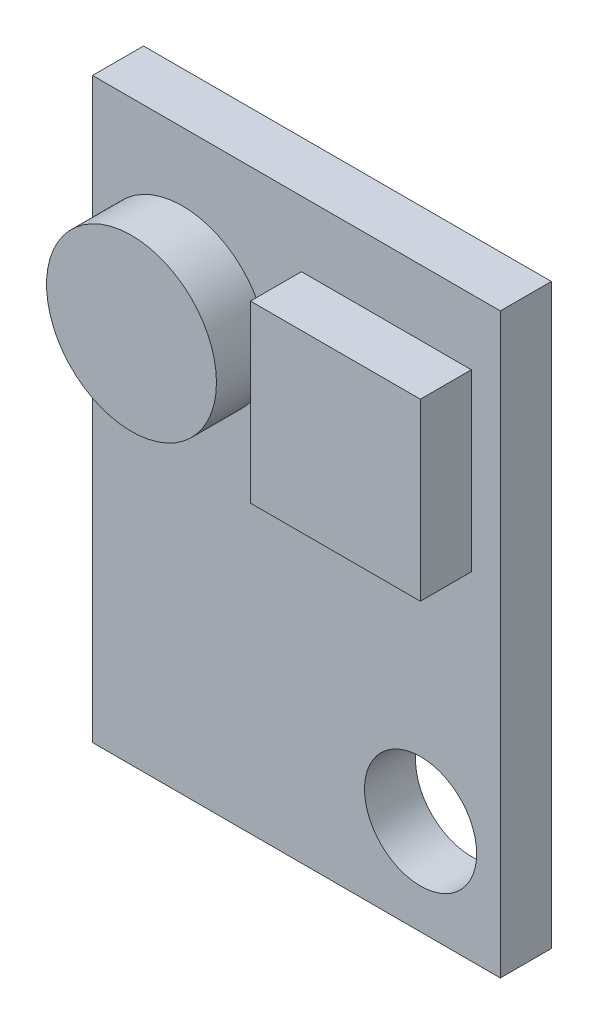
ISO-10303-21;
HEADER;
FILE_DESCRIPTION(('STEP AP214'),'2;1');
FILE_NAME('part.step','',(''),(''),'','','');
FILE_SCHEMA(('AUTOMOTIVE_DESIGN { 1 0 10303 214 1 1 1 1 }'));
ENDSEC;
DATA;
#1=APPLICATION_CONTEXT('core data for automotive mechanical design processes');
#2=APPLICATION_PROTOCOL_DEFINITION('international standard','automotive_design',2000,#1);
#3=PRODUCT_CONTEXT('',#1,'mechanical');
#4=PRODUCT('Part','Part','',(#3));
#5=PRODUCT_RELATED_PRODUCT_CATEGORY('part','',(#4));
#6=PRODUCT_DEFINITION_FORMATION('','',#4);
#7=PRODUCT_DEFINITION_CONTEXT('part definition',#1,'design');
#8=PRODUCT_DEFINITION('design','',#6,#7);
#9=PRODUCT_DEFINITION_SHAPE('','',#8);
#10=(LENGTH_UNIT() NAMED_UNIT(*) SI_UNIT(.MILLI.,.METRE.));
#11=(NAMED_UNIT(*) PLANE_ANGLE_UNIT() SI_UNIT($,.RADIAN.));
#12=(NAMED_UNIT(*) SI_UNIT($,.STERADIAN.) SOLID_ANGLE_UNIT());
#13=UNCERTAINTY_MEASURE_WITH_UNIT(LENGTH_MEASURE(1.E-05),#10,'distance_accuracy_value','');
#14=(GEOMETRIC_REPRESENTATION_CONTEXT(3) GLOBAL_UNCERTAINTY_ASSIGNED_CONTEXT((#13)) GLOBAL_UNIT_ASSIGNED_CONTEXT((#10,
#11,#12)) REPRESENTATION_CONTEXT('',''));
#15=CARTESIAN_POINT('',(0.,0.,0.));
#16=DIRECTION('',(0.,0.,1.));
#17=DIRECTION('',(1.,0.,0.));
#18=AXIS2_PLACEMENT_3D('',#15,#16,#17);
#19=CARTESIAN_POINT('',(0.,0.,1.5));
#20=DIRECTION('',(0.,0.,1.));
#21=DIRECTION('',(1.,0.,0.));
#22=AXIS2_PLACEMENT_3D('',#19,#20,#21);
#23=PLANE('',#22);
#24=CARTESIAN_POINT('',(-3.35370620417374,3.99878778091534,1.5));
#25=DIRECTION('',(0.,0.,1.));
#26=DIRECTION('',(1.,0.,0.));
#27=AXIS2_PLACEMENT_3D('',#24,#25,#26);
#28=CIRCLE('',#27,2.5);
#29=CARTESIAN_POINT('',(-0.853706204173739,3.99878778091534,1.5));
#30=VERTEX_POINT('',#29);
#31=EDGE_CURVE('E132',#30,#30,#28,.T.);
#32=ORIENTED_EDGE('',*,*,#31,.F.);
#33=EDGE_LOOP('',(#32));
#34=FACE_BOUND('',#33,.T.);
#35=DIRECTION('',(0.,1.,0.));
#36=VECTOR('',#35,1.);
#37=CARTESIAN_POINT('',(6.,8.5,1.5));
#38=LINE('',#37,#36);
#39=CARTESIAN_POINT('',(6.,-8.5,1.5));
#40=VERTEX_POINT('',#39);
#41=CARTESIAN_POINT('',(6.,8.5,1.5));
#42=VERTEX_POINT('',#41);
#43=EDGE_CURVE('E149',#40,#42,#38,.T.);
#44=ORIENTED_EDGE('',*,*,#43,.T.);
#45=DIRECTION('',(-1.,0.,0.));
#46=VECTOR('',#45,1.);
#47=CARTESIAN_POINT('',(-6.,8.5,1.5));
#48=LINE('',#47,#46);
#49=CARTESIAN_POINT('',(-6.,8.5,1.5));
#50=VERTEX_POINT('',#49);
#51=EDGE_CURVE('E85',#42,#50,#48,.T.);
#52=ORIENTED_EDGE('',*,*,#51,.T.);
#53=DIRECTION('',(0.,-1.,0.));
#54=VECTOR('',#53,1.);
#55=CARTESIAN_POINT('',(-6.,8.5,1.5));
#56=LINE('',#55,#54);
#57=CARTESIAN_POINT('',(-6.,-8.5,1.5));
#58=VERTEX_POINT('',#57);
#59=EDGE_CURVE('E152',#50,#58,#56,.T.);
#60=ORIENTED_EDGE('',*,*,#59,.T.);
#61=DIRECTION('',(1.,0.,0.));
#62=VECTOR('',#61,1.);
#63=CARTESIAN_POINT('',(-6.,-8.5,1.5));
#64=LINE('',#63,#62);
#65=EDGE_CURVE('E57',#58,#40,#64,.T.);
#66=ORIENTED_EDGE('',*,*,#65,.T.);
#67=EDGE_LOOP('',(#44,#52,#60,#66));
#68=FACE_BOUND('',#67,.T.);
#69=CARTESIAN_POINT('',(3.65276492354383,-5.68227492873241,1.5));
#70=DIRECTION('',(0.,0.,1.));
#71=DIRECTION('',(1.,0.,0.));
#72=AXIS2_PLACEMENT_3D('',#69,#70,#71);
#73=CIRCLE('',#72,1.65);
#74=CARTESIAN_POINT('',(5.30276492354383,-5.68227492873241,1.5));
#75=VERTEX_POINT('',#74);
#76=EDGE_CURVE('E143',#75,#75,#73,.T.);
#77=ORIENTED_EDGE('',*,*,#76,.F.);
#78=EDGE_LOOP('',(#77));
#79=FACE_BOUND('',#78,.T.);
#80=DIRECTION('',(-1.,0.,0.));
#81=VECTOR('',#80,1.);
#82=CARTESIAN_POINT('',(0.14629379582626,6.57280356671208,1.5));
#83=LINE('',#82,#81);
#84=CARTESIAN_POINT('',(5.14629379582626,6.57280356671208,1.5));
#85=VERTEX_POINT('',#84);
#86=CARTESIAN_POINT('',(0.14629379582626,6.57280356671208,1.5));
#87=VERTEX_POINT('',#86);
#88=EDGE_CURVE('E308',#85,#87,#83,.T.);
#89=ORIENTED_EDGE('',*,*,#88,.F.);
#90=DIRECTION('',(0.,1.,0.));
#91=VECTOR('',#90,1.);
#92=CARTESIAN_POINT('',(5.14629379582626,6.57280356671208,1.5));
#93=LINE('',#92,#91);
#94=CARTESIAN_POINT('',(5.14629379582626,1.42477199511859,1.5));
#95=VERTEX_POINT('',#94);
#96=EDGE_CURVE('E130',#95,#85,#93,.T.);
#97=ORIENTED_EDGE('',*,*,#96,.F.);
#98=DIRECTION('',(1.,0.,0.));
#99=VECTOR('',#98,1.);
#100=CARTESIAN_POINT('',(0.14629379582626,1.42477199511859,1.5));
#101=LINE('',#100,#99);
#102=CARTESIAN_POINT('',(0.14629379582626,1.42477199511859,1.5));
#103=VERTEX_POINT('',#102);
#104=EDGE_CURVE('E126',#103,#95,#101,.T.);
#105=ORIENTED_EDGE('',*,*,#104,.F.);
#106=DIRECTION('',(0.,-1.,0.));
#107=VECTOR('',#106,1.);
#108=CARTESIAN_POINT('',(0.14629379582626,6.57280356671208,1.5));
#109=LINE('',#108,#107);
#110=EDGE_CURVE('E305',#87,#103,#109,.T.);
#111=ORIENTED_EDGE('',*,*,#110,.F.);
#112=EDGE_LOOP('',(#89,#97,#105,#111));
#113=FACE_BOUND('',#112,.T.);
#114=ADVANCED_FACE('F33',(#34,#68,#79,#113),#23,.T.);
#115=CARTESIAN_POINT('',(0.,0.,0.));
#116=DIRECTION('',(0.,0.,1.));
#117=DIRECTION('',(1.,0.,0.));
#118=AXIS2_PLACEMENT_3D('',#115,#116,#117);
#119=PLANE('',#118);
#120=DIRECTION('',(0.,1.,0.));
#121=VECTOR('',#120,1.);
#122=CARTESIAN_POINT('',(6.,8.5,0.));
#123=LINE('',#122,#121);
#124=CARTESIAN_POINT('',(6.,-8.5,0.));
#125=VERTEX_POINT('',#124);
#126=CARTESIAN_POINT('',(6.,8.5,0.));
#127=VERTEX_POINT('',#126);
#128=EDGE_CURVE('E146',#125,#127,#123,.T.);
#129=ORIENTED_EDGE('',*,*,#128,.F.);
#130=DIRECTION('',(1.,0.,0.));
#131=VECTOR('',#130,1.);
#132=CARTESIAN_POINT('',(-6.,-8.5,0.));
#133=LINE('',#132,#131);
#134=CARTESIAN_POINT('',(-6.,-8.5,0.));
#135=VERTEX_POINT('',#134);
#136=EDGE_CURVE('E78',#135,#125,#133,.T.);
#137=ORIENTED_EDGE('',*,*,#136,.F.);
#138=DIRECTION('',(0.,-1.,0.));
#139=VECTOR('',#138,1.);
#140=CARTESIAN_POINT('',(-6.,8.5,0.));
#141=LINE('',#140,#139);
#142=CARTESIAN_POINT('',(-6.,8.5,0.));
#143=VERTEX_POINT('',#142);
#144=EDGE_CURVE('E160',#143,#135,#141,.T.);
#145=ORIENTED_EDGE('',*,*,#144,.F.);
#146=DIRECTION('',(-1.,0.,0.));
#147=VECTOR('',#146,1.);
#148=CARTESIAN_POINT('',(-6.,8.5,0.));
#149=LINE('',#148,#147);
#150=EDGE_CURVE('E158',#127,#143,#149,.T.);
#151=ORIENTED_EDGE('',*,*,#150,.F.);
#152=EDGE_LOOP('',(#129,#137,#145,#151));
#153=FACE_BOUND('',#152,.T.);
#154=CARTESIAN_POINT('',(3.65276492354383,-5.68227492873241,0.));
#155=DIRECTION('',(0.,0.,1.));
#156=DIRECTION('',(1.,0.,0.));
#157=AXIS2_PLACEMENT_3D('',#154,#155,#156);
#158=CIRCLE('',#157,1.65);
#159=CARTESIAN_POINT('',(5.30276492354383,-5.68227492873241,0.));
#160=VERTEX_POINT('',#159);
#161=EDGE_CURVE('E141',#160,#160,#158,.T.);
#162=ORIENTED_EDGE('',*,*,#161,.T.);
#163=EDGE_LOOP('',(#162));
#164=FACE_BOUND('',#163,.T.);
#165=ADVANCED_FACE('F173',(#153,#164),#119,.F.);
#166=CARTESIAN_POINT('',(6.,8.5,1.5));
#167=DIRECTION('',(-1.,0.,0.));
#168=DIRECTION('',(0.,-1.,0.));
#169=AXIS2_PLACEMENT_3D('',#166,#167,#168);
#170=PLANE('',#169);
#171=ORIENTED_EDGE('',*,*,#128,.T.);
#172=DIRECTION('',(0.,0.,-1.));
#173=VECTOR('',#172,1.);
#174=CARTESIAN_POINT('',(6.,8.5,1.5));
#175=LINE('',#174,#173);
#176=EDGE_CURVE('E11',#42,#127,#175,.T.);
#177=ORIENTED_EDGE('',*,*,#176,.F.);
#178=ORIENTED_EDGE('',*,*,#43,.F.);
#179=DIRECTION('',(0.,0.,-1.));
#180=VECTOR('',#179,1.);
#181=CARTESIAN_POINT('',(6.,-8.5,1.5));
#182=LINE('',#181,#180);
#183=EDGE_CURVE('E155',#40,#125,#182,.T.);
#184=ORIENTED_EDGE('',*,*,#183,.T.);
#185=EDGE_LOOP('',(#171,#177,#178,#184));
#186=FACE_BOUND('',#185,.T.);
#187=ADVANCED_FACE('F35',(#186),#170,.F.);
#188=CARTESIAN_POINT('',(-6.,8.5,1.5));
#189=DIRECTION('',(0.,-1.,0.));
#190=DIRECTION('',(0.,0.,-1.));
#191=AXIS2_PLACEMENT_3D('',#188,#189,#190);
#192=PLANE('',#191);
#193=ORIENTED_EDGE('',*,*,#150,.T.);
#194=DIRECTION('',(0.,0.,-1.));
#195=VECTOR('',#194,1.);
#196=CARTESIAN_POINT('',(-6.,8.5,1.5));
#197=LINE('',#196,#195);
#198=EDGE_CURVE('E41',#50,#143,#197,.T.);
#199=ORIENTED_EDGE('',*,*,#198,.F.);
#200=ORIENTED_EDGE('',*,*,#51,.F.);
#201=ORIENTED_EDGE('',*,*,#176,.T.);
#202=EDGE_LOOP('',(#193,#199,#200,#201));
#203=FACE_BOUND('',#202,.T.);
#204=ADVANCED_FACE('F189',(#203),#192,.F.);
#205=CARTESIAN_POINT('',(-6.,8.5,1.5));
#206=DIRECTION('',(1.,0.,0.));
#207=DIRECTION('',(0.,1.,0.));
#208=AXIS2_PLACEMENT_3D('',#205,#206,#207);
#209=PLANE('',#208);
#210=ORIENTED_EDGE('',*,*,#144,.T.);
#211=DIRECTION('',(0.,0.,-1.));
#212=VECTOR('',#211,1.);
#213=CARTESIAN_POINT('',(-6.,-8.5,1.5));
#214=LINE('',#213,#212);
#215=EDGE_CURVE('E164',#58,#135,#214,.T.);
#216=ORIENTED_EDGE('',*,*,#215,.F.);
#217=ORIENTED_EDGE('',*,*,#59,.F.);
#218=ORIENTED_EDGE('',*,*,#198,.T.);
#219=EDGE_LOOP('',(#210,#216,#217,#218));
#220=FACE_BOUND('',#219,.T.);
#221=ADVANCED_FACE('F169',(#220),#209,.F.);
#222=CARTESIAN_POINT('',(-6.,-8.5,1.5));
#223=DIRECTION('',(0.,1.,0.));
#224=DIRECTION('',(0.,0.,1.));
#225=AXIS2_PLACEMENT_3D('',#222,#223,#224);
#226=PLANE('',#225);
#227=ORIENTED_EDGE('',*,*,#136,.T.);
#228=ORIENTED_EDGE('',*,*,#183,.F.);
#229=ORIENTED_EDGE('',*,*,#65,.F.);
#230=ORIENTED_EDGE('',*,*,#215,.T.);
#231=EDGE_LOOP('',(#227,#228,#229,#230));
#232=FACE_BOUND('',#231,.T.);
#233=ADVANCED_FACE('F178',(#232),#226,.F.);
#234=CARTESIAN_POINT('',(3.65276492354383,-5.68227492873241,1.5));
#235=DIRECTION('',(0.,0.,-1.));
#236=DIRECTION('',(-1.,0.,0.));
#237=AXIS2_PLACEMENT_3D('',#234,#235,#236);
#238=CYLINDRICAL_SURFACE('',#237,1.65);
#239=ORIENTED_EDGE('',*,*,#76,.T.);
#240=EDGE_LOOP('',(#239));
#241=FACE_BOUND('',#240,.T.);
#242=ORIENTED_EDGE('',*,*,#161,.F.);
#243=EDGE_LOOP('',(#242));
#244=FACE_BOUND('',#243,.T.);
#245=ADVANCED_FACE('F180',(#241,#244),#238,.F.);
#246=CARTESIAN_POINT('',(-3.35370620417374,3.99878778091534,3.));
#247=DIRECTION('',(0.,0.,-1.));
#248=DIRECTION('',(-1.,0.,0.));
#249=AXIS2_PLACEMENT_3D('',#246,#247,#248);
#250=CYLINDRICAL_SURFACE('',#249,2.5);
#251=CARTESIAN_POINT('',(-3.35370620417374,3.99878778091534,3.));
#252=DIRECTION('',(0.,0.,1.));
#253=DIRECTION('',(1.,0.,0.));
#254=AXIS2_PLACEMENT_3D('',#251,#252,#253);
#255=CIRCLE('',#254,2.5);
#256=CARTESIAN_POINT('',(-0.853706204173739,3.99878778091534,3.));
#257=VERTEX_POINT('',#256);
#258=EDGE_CURVE('E135',#257,#257,#255,.T.);
#259=ORIENTED_EDGE('',*,*,#258,.F.);
#260=EDGE_LOOP('',(#259));
#261=FACE_BOUND('',#260,.T.);
#262=ORIENTED_EDGE('',*,*,#31,.T.);
#263=EDGE_LOOP('',(#262));
#264=FACE_BOUND('',#263,.T.);
#265=ADVANCED_FACE('F186',(#261,#264),#250,.T.);
#266=CARTESIAN_POINT('',(-3.35370620417374,3.99878778091534,3.));
#267=DIRECTION('',(0.,0.,1.));
#268=DIRECTION('',(1.,0.,0.));
#269=AXIS2_PLACEMENT_3D('',#266,#267,#268);
#270=PLANE('',#269);
#271=ORIENTED_EDGE('',*,*,#258,.T.);
#272=EDGE_LOOP('',(#271));
#273=FACE_BOUND('',#272,.T.);
#274=ADVANCED_FACE('F202',(#273),#270,.T.);
#275=CARTESIAN_POINT('',(5.14629379582626,6.57280356671208,3.));
#276=DIRECTION('',(-1.,0.,0.));
#277=DIRECTION('',(0.,0.,1.));
#278=AXIS2_PLACEMENT_3D('',#275,#276,#277);
#279=PLANE('',#278);
#280=ORIENTED_EDGE('',*,*,#96,.T.);
#281=DIRECTION('',(0.,0.,-1.));
#282=VECTOR('',#281,1.);
#283=CARTESIAN_POINT('',(5.14629379582626,6.57280356671208,3.));
#284=LINE('',#283,#282);
#285=CARTESIAN_POINT('',(5.14629379582626,6.57280356671208,3.));
#286=VERTEX_POINT('',#285);
#287=EDGE_CURVE('E111',#286,#85,#284,.T.);
#288=ORIENTED_EDGE('',*,*,#287,.F.);
#289=DIRECTION('',(0.,1.,0.));
#290=VECTOR('',#289,1.);
#291=CARTESIAN_POINT('',(5.14629379582626,6.57280356671208,3.));
#292=LINE('',#291,#290);
#293=CARTESIAN_POINT('',(5.14629379582626,1.42477199511859,3.));
#294=VERTEX_POINT('',#293);
#295=EDGE_CURVE('E118',#294,#286,#292,.T.);
#296=ORIENTED_EDGE('',*,*,#295,.F.);
#297=DIRECTION('',(0.,0.,-1.));
#298=VECTOR('',#297,1.);
#299=CARTESIAN_POINT('',(5.14629379582626,1.42477199511859,3.));
#300=LINE('',#299,#298);
#301=EDGE_CURVE('E302',#294,#95,#300,.T.);
#302=ORIENTED_EDGE('',*,*,#301,.T.);
#303=EDGE_LOOP('',(#280,#288,#296,#302));
#304=FACE_BOUND('',#303,.T.);
#305=ADVANCED_FACE('F128',(#304),#279,.F.);
#306=CARTESIAN_POINT('',(0.14629379582626,6.57280356671208,3.));
#307=DIRECTION('',(0.,-1.,0.));
#308=DIRECTION('',(0.,0.,-1.));
#309=AXIS2_PLACEMENT_3D('',#306,#307,#308);
#310=PLANE('',#309);
#311=ORIENTED_EDGE('',*,*,#88,.T.);
#312=DIRECTION('',(0.,0.,-1.));
#313=VECTOR('',#312,1.);
#314=CARTESIAN_POINT('',(0.14629379582626,6.57280356671208,3.));
#315=LINE('',#314,#313);
#316=CARTESIAN_POINT('',(0.14629379582626,6.57280356671208,3.));
#317=VERTEX_POINT('',#316);
#318=EDGE_CURVE('E114',#317,#87,#315,.T.);
#319=ORIENTED_EDGE('',*,*,#318,.F.);
#320=DIRECTION('',(-1.,0.,0.));
#321=VECTOR('',#320,1.);
#322=CARTESIAN_POINT('',(0.14629379582626,6.57280356671208,3.));
#323=LINE('',#322,#321);
#324=EDGE_CURVE('E107',#286,#317,#323,.T.);
#325=ORIENTED_EDGE('',*,*,#324,.F.);
#326=ORIENTED_EDGE('',*,*,#287,.T.);
#327=EDGE_LOOP('',(#311,#319,#325,#326));
#328=FACE_BOUND('',#327,.T.);
#329=ADVANCED_FACE('F109',(#328),#310,.F.);
#330=CARTESIAN_POINT('',(0.14629379582626,6.57280356671208,3.));
#331=DIRECTION('',(1.,0.,0.));
#332=DIRECTION('',(0.,1.,0.));
#333=AXIS2_PLACEMENT_3D('',#330,#331,#332);
#334=PLANE('',#333);
#335=ORIENTED_EDGE('',*,*,#110,.T.);
#336=DIRECTION('',(0.,0.,-1.));
#337=VECTOR('',#336,1.);
#338=CARTESIAN_POINT('',(0.14629379582626,1.42477199511859,3.));
#339=LINE('',#338,#337);
#340=CARTESIAN_POINT('',(0.14629379582626,1.42477199511859,3.));
#341=VERTEX_POINT('',#340);
#342=EDGE_CURVE('E48',#341,#103,#339,.T.);
#343=ORIENTED_EDGE('',*,*,#342,.F.);
#344=DIRECTION('',(0.,-1.,0.));
#345=VECTOR('',#344,1.);
#346=CARTESIAN_POINT('',(0.14629379582626,6.57280356671208,3.));
#347=LINE('',#346,#345);
#348=EDGE_CURVE('E117',#317,#341,#347,.T.);
#349=ORIENTED_EDGE('',*,*,#348,.F.);
#350=ORIENTED_EDGE('',*,*,#318,.T.);
#351=EDGE_LOOP('',(#335,#343,#349,#350));
#352=FACE_BOUND('',#351,.T.);
#353=ADVANCED_FACE('F211',(#352),#334,.F.);
#354=CARTESIAN_POINT('',(0.14629379582626,1.42477199511859,3.));
#355=DIRECTION('',(0.,1.,0.));
#356=DIRECTION('',(0.,0.,1.));
#357=AXIS2_PLACEMENT_3D('',#354,#355,#356);
#358=PLANE('',#357);
#359=ORIENTED_EDGE('',*,*,#104,.T.);
#360=ORIENTED_EDGE('',*,*,#301,.F.);
#361=DIRECTION('',(1.,0.,0.));
#362=VECTOR('',#361,1.);
#363=CARTESIAN_POINT('',(0.14629379582626,1.42477199511859,3.));
#364=LINE('',#363,#362);
#365=EDGE_CURVE('E122',#341,#294,#364,.T.);
#366=ORIENTED_EDGE('',*,*,#365,.F.);
#367=ORIENTED_EDGE('',*,*,#342,.T.);
#368=EDGE_LOOP('',(#359,#360,#366,#367));
#369=FACE_BOUND('',#368,.T.);
#370=ADVANCED_FACE('F214',(#369),#358,.F.);
#371=CARTESIAN_POINT('',(0.,0.,3.));
#372=DIRECTION('',(0.,0.,1.));
#373=DIRECTION('',(1.,0.,0.));
#374=AXIS2_PLACEMENT_3D('',#371,#372,#373);
#375=PLANE('',#374);
#376=ORIENTED_EDGE('',*,*,#295,.T.);
#377=ORIENTED_EDGE('',*,*,#324,.T.);
#378=ORIENTED_EDGE('',*,*,#348,.T.);
#379=ORIENTED_EDGE('',*,*,#365,.T.);
#380=EDGE_LOOP('',(#376,#377,#378,#379));
#381=FACE_BOUND('',#380,.T.);
#382=ADVANCED_FACE('F121',(#381),#375,.T.);
#383=CLOSED_SHELL('',(#114,#165,#187,#204,#221,#233,#245,#265,#274,#305,#329,#353,#370,#382));
#384=MANIFOLD_SOLID_BREP('B2',#383);
#385=ADVANCED_BREP_SHAPE_REPRESENTATION('',(#18,#384),#14);
#386=SHAPE_DEFINITION_REPRESENTATION(#9,#385);
ENDSEC;
END-ISO-10303-21;
